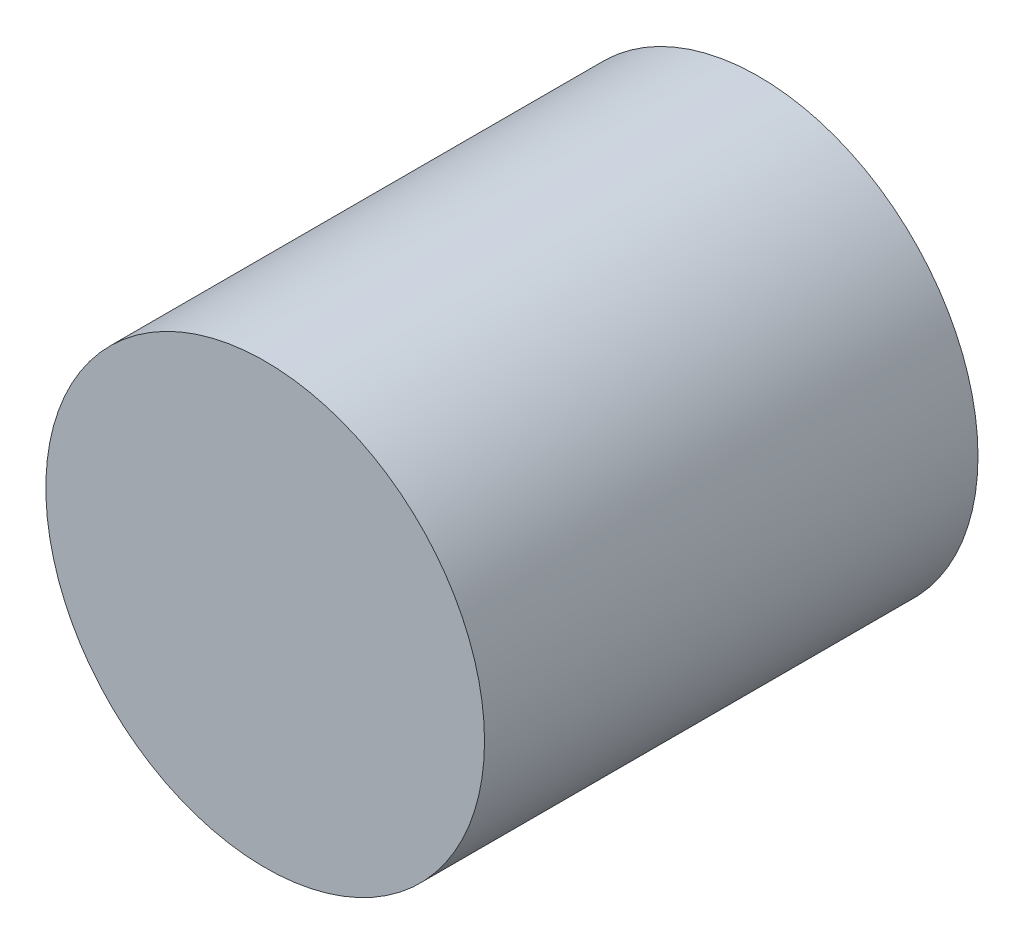
ISO-10303-21;
HEADER;
FILE_DESCRIPTION(('STEP AP214'),'2;1');
FILE_NAME('part.step','',(''),(''),'','','');
FILE_SCHEMA(('AUTOMOTIVE_DESIGN { 1 0 10303 214 1 1 1 1 }'));
ENDSEC;
DATA;
#1=APPLICATION_CONTEXT('core data for automotive mechanical design processes');
#2=APPLICATION_PROTOCOL_DEFINITION('international standard','automotive_design',2000,#1);
#3=PRODUCT_CONTEXT('',#1,'mechanical');
#4=PRODUCT('Part','Part','',(#3));
#5=PRODUCT_RELATED_PRODUCT_CATEGORY('part','',(#4));
#6=PRODUCT_DEFINITION_FORMATION('','',#4);
#7=PRODUCT_DEFINITION_CONTEXT('part definition',#1,'design');
#8=PRODUCT_DEFINITION('design','',#6,#7);
#9=PRODUCT_DEFINITION_SHAPE('','',#8);
#10=(LENGTH_UNIT() NAMED_UNIT(*) SI_UNIT(.MILLI.,.METRE.));
#11=(NAMED_UNIT(*) PLANE_ANGLE_UNIT() SI_UNIT($,.RADIAN.));
#12=(NAMED_UNIT(*) SI_UNIT($,.STERADIAN.) SOLID_ANGLE_UNIT());
#13=UNCERTAINTY_MEASURE_WITH_UNIT(LENGTH_MEASURE(1.E-05),#10,'distance_accuracy_value','');
#14=(GEOMETRIC_REPRESENTATION_CONTEXT(3) GLOBAL_UNCERTAINTY_ASSIGNED_CONTEXT((#13)) GLOBAL_UNIT_ASSIGNED_CONTEXT((#10,
#11,#12)) REPRESENTATION_CONTEXT('',''));
#15=CARTESIAN_POINT('',(0.,0.,0.));
#16=DIRECTION('',(0.,0.,1.));
#17=DIRECTION('',(1.,0.,0.));
#18=AXIS2_PLACEMENT_3D('',#15,#16,#17);
#19=CARTESIAN_POINT('',(6.34999999999999,-1.83186799063151E-12,1.25));
#20=DIRECTION('',(0.,0.,-1.));
#21=DIRECTION('',(-1.,0.,0.));
#22=AXIS2_PLACEMENT_3D('',#19,#20,#21);
#23=CYLINDRICAL_SURFACE('',#22,1.77799999999973);
#24=CARTESIAN_POINT('',(6.34999999999999,-1.83186799063151E-12,1.25));
#25=DIRECTION('',(0.,0.,1.));
#26=DIRECTION('',(1.,0.,0.));
#27=AXIS2_PLACEMENT_3D('',#24,#25,#26);
#28=CIRCLE('',#27,1.77799999999973);
#29=CARTESIAN_POINT('',(8.12799999999972,-1.83186799063151E-12,1.25));
#30=VERTEX_POINT('',#29);
#31=EDGE_CURVE('E10',#30,#30,#28,.T.);
#32=ORIENTED_EDGE('',*,*,#31,.F.);
#33=EDGE_LOOP('',(#32));
#34=FACE_BOUND('',#33,.T.);
#35=CARTESIAN_POINT('',(6.34999999999999,-1.83186799063151E-12,-2.75));
#36=DIRECTION('',(0.,0.,1.));
#37=DIRECTION('',(1.,0.,0.));
#38=AXIS2_PLACEMENT_3D('',#35,#36,#37);
#39=CIRCLE('',#38,1.77799999999973);
#40=CARTESIAN_POINT('',(8.12799999999972,-1.83186799063151E-12,-2.75));
#41=VERTEX_POINT('',#40);
#42=EDGE_CURVE('E35',#41,#41,#39,.T.);
#43=ORIENTED_EDGE('',*,*,#42,.T.);
#44=EDGE_LOOP('',(#43));
#45=FACE_BOUND('',#44,.T.);
#46=ADVANCED_FACE('F29',(#34,#45),#23,.T.);
#47=CARTESIAN_POINT('',(6.34999999999999,-1.83186799063151E-12,1.25));
#48=DIRECTION('',(0.,0.,1.));
#49=DIRECTION('',(1.,0.,0.));
#50=AXIS2_PLACEMENT_3D('',#47,#48,#49);
#51=PLANE('',#50);
#52=ORIENTED_EDGE('',*,*,#31,.T.);
#53=EDGE_LOOP('',(#52));
#54=FACE_BOUND('',#53,.T.);
#55=ADVANCED_FACE('F44',(#54),#51,.T.);
#56=CARTESIAN_POINT('',(6.34999999999999,-1.83186799063151E-12,-2.75));
#57=DIRECTION('',(0.,0.,1.));
#58=DIRECTION('',(1.,0.,0.));
#59=AXIS2_PLACEMENT_3D('',#56,#57,#58);
#60=PLANE('',#59);
#61=ORIENTED_EDGE('',*,*,#42,.F.);
#62=EDGE_LOOP('',(#61));
#63=FACE_BOUND('',#62,.T.);
#64=ADVANCED_FACE('F42',(#63),#60,.F.);
#65=CLOSED_SHELL('',(#46,#55,#64));
#66=MANIFOLD_SOLID_BREP('B2',#65);
#67=ADVANCED_BREP_SHAPE_REPRESENTATION('',(#18,#66),#14);
#68=SHAPE_DEFINITION_REPRESENTATION(#9,#67);
ENDSEC;
END-ISO-10303-21;
